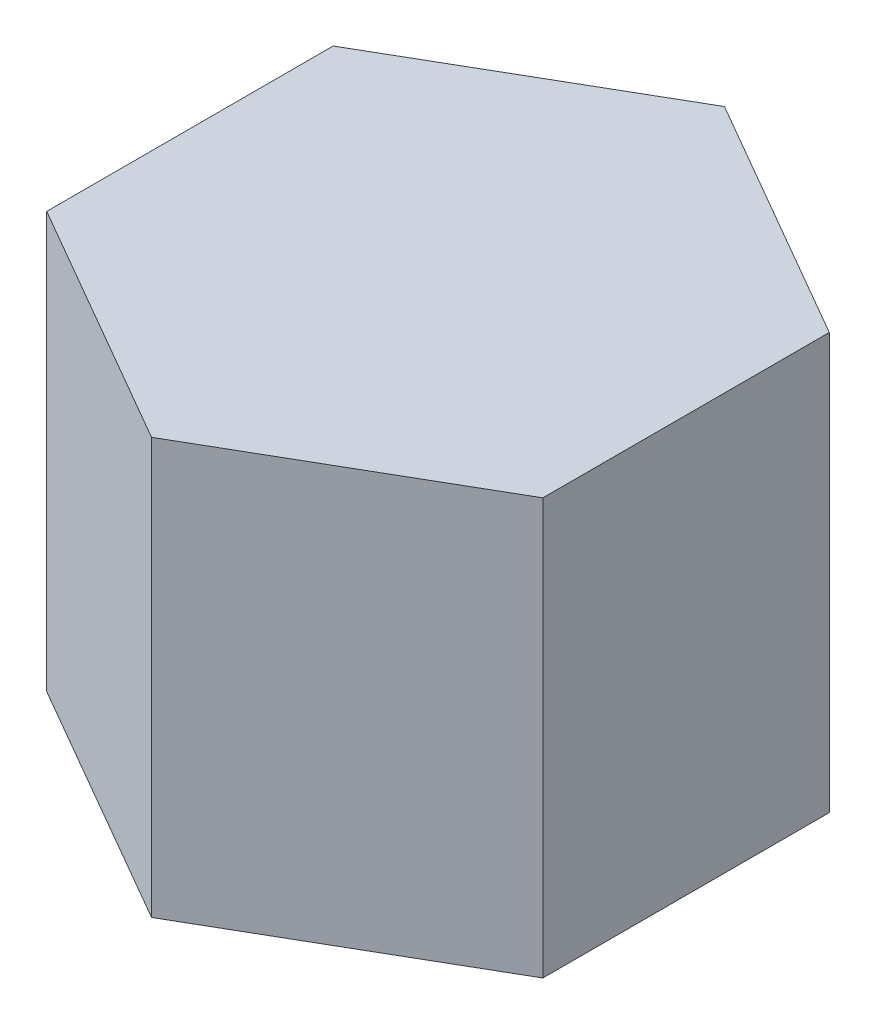
ISO-10303-21;
HEADER;
FILE_DESCRIPTION(('STEP AP214'),'2;1');
FILE_NAME('part.step','',(''),(''),'','','');
FILE_SCHEMA(('AUTOMOTIVE_DESIGN { 1 0 10303 214 1 1 1 1 }'));
ENDSEC;
DATA;
#1=APPLICATION_CONTEXT('core data for automotive mechanical design processes');
#2=APPLICATION_PROTOCOL_DEFINITION('international standard','automotive_design',2000,#1);
#3=PRODUCT_CONTEXT('',#1,'mechanical');
#4=PRODUCT('Part','Part','',(#3));
#5=PRODUCT_RELATED_PRODUCT_CATEGORY('part','',(#4));
#6=PRODUCT_DEFINITION_FORMATION('','',#4);
#7=PRODUCT_DEFINITION_CONTEXT('part definition',#1,'design');
#8=PRODUCT_DEFINITION('design','',#6,#7);
#9=PRODUCT_DEFINITION_SHAPE('','',#8);
#10=(LENGTH_UNIT() NAMED_UNIT(*) SI_UNIT(.MILLI.,.METRE.));
#11=(NAMED_UNIT(*) PLANE_ANGLE_UNIT() SI_UNIT($,.RADIAN.));
#12=(NAMED_UNIT(*) SI_UNIT($,.STERADIAN.) SOLID_ANGLE_UNIT());
#13=UNCERTAINTY_MEASURE_WITH_UNIT(LENGTH_MEASURE(1.E-05),#10,'distance_accuracy_value','');
#14=(GEOMETRIC_REPRESENTATION_CONTEXT(3) GLOBAL_UNCERTAINTY_ASSIGNED_CONTEXT((#13)) GLOBAL_UNIT_ASSIGNED_CONTEXT((#10,
#11,#12)) REPRESENTATION_CONTEXT('',''));
#15=CARTESIAN_POINT('',(0.,0.,0.));
#16=DIRECTION('',(0.,0.,1.));
#17=DIRECTION('',(1.,0.,0.));
#18=AXIS2_PLACEMENT_3D('',#15,#16,#17);
#19=CARTESIAN_POINT('',(202.142660308706,-148.537700895744,287.176844201572));
#20=DIRECTION('',(-0.499999999999943,0.,-0.866025403784472));
#21=DIRECTION('',(-0.866025403784472,0.,0.499999999999943));
#22=AXIS2_PLACEMENT_3D('',#19,#20,#21);
#23=PLANE('',#22);
#24=CARTESIAN_POINT('',(201.839551417382,-149.045793579175,287.351844201572));
#25=DIRECTION('',(0.866025403784471,0.,-0.499999999999943));
#26=VECTOR('',#25,1.);
#27=LINE('',#24,#26);
#28=CARTESIAN_POINT('',(201.839551417382,-149.045793579175,287.351844201572));
#29=VERTEX_POINT('',#28);
#30=CARTESIAN_POINT('',(202.142660308706,-149.045793579175,287.176844201572));
#31=VERTEX_POINT('',#30);
#32=EDGE_CURVE('E170',#29,#31,#27,.T.);
#33=ORIENTED_EDGE('',*,*,#32,.T.);
#34=CARTESIAN_POINT('',(202.142660308706,-148.537700895744,287.176844201572));
#35=DIRECTION('',(0.,-1.,0.));
#36=VECTOR('',#35,1.);
#37=LINE('',#34,#36);
#38=CARTESIAN_POINT('',(202.142660308706,-148.537700895744,287.176844201572));
#39=VERTEX_POINT('',#38);
#40=EDGE_CURVE('E35',#39,#31,#37,.T.);
#41=ORIENTED_EDGE('',*,*,#40,.F.);
#42=CARTESIAN_POINT('',(201.839551417382,-148.537700895744,287.351844201572));
#43=DIRECTION('',(0.866025403784471,0.,-0.499999999999943));
#44=VECTOR('',#43,1.);
#45=LINE('',#42,#44);
#46=CARTESIAN_POINT('',(201.839551417382,-148.537700895744,287.351844201572));
#47=VERTEX_POINT('',#46);
#48=EDGE_CURVE('E159',#47,#39,#45,.T.);
#49=ORIENTED_EDGE('',*,*,#48,.F.);
#50=CARTESIAN_POINT('',(201.839551417382,-148.537700895744,287.351844201572));
#51=DIRECTION('',(0.,-1.,0.));
#52=VECTOR('',#51,1.);
#53=LINE('',#50,#52);
#54=EDGE_CURVE('E10',#47,#29,#53,.T.);
#55=ORIENTED_EDGE('',*,*,#54,.T.);
#56=EDGE_LOOP('',(#33,#41,#49,#55));
#57=FACE_BOUND('',#56,.T.);
#58=ADVANCED_FACE('F16',(#57),#23,.F.);
#59=CARTESIAN_POINT('',(201.839551417382,-148.537700895744,287.351844201572));
#60=DIRECTION('',(0.500000000000062,0.,-0.866025403784403));
#61=DIRECTION('',(-0.866025403784403,0.,-0.500000000000062));
#62=AXIS2_PLACEMENT_3D('',#59,#60,#61);
#63=PLANE('',#62);
#64=CARTESIAN_POINT('',(201.536442526057,-149.045793579175,287.176844201572));
#65=DIRECTION('',(0.866025403784403,0.,0.500000000000062));
#66=VECTOR('',#65,1.);
#67=LINE('',#64,#66);
#68=CARTESIAN_POINT('',(201.536442526057,-149.045793579175,287.176844201572));
#69=VERTEX_POINT('',#68);
#70=EDGE_CURVE('E167',#69,#29,#67,.T.);
#71=ORIENTED_EDGE('',*,*,#70,.T.);
#72=ORIENTED_EDGE('',*,*,#54,.F.);
#73=CARTESIAN_POINT('',(201.536442526057,-148.537700895744,287.176844201572));
#74=DIRECTION('',(0.866025403784403,0.,0.500000000000062));
#75=VECTOR('',#74,1.);
#76=LINE('',#73,#75);
#77=CARTESIAN_POINT('',(201.536442526057,-148.537700895744,287.176844201572));
#78=VERTEX_POINT('',#77);
#79=EDGE_CURVE('E156',#78,#47,#76,.T.);
#80=ORIENTED_EDGE('',*,*,#79,.F.);
#81=CARTESIAN_POINT('',(201.536442526057,-148.537700895744,287.176844201572));
#82=DIRECTION('',(0.,-1.,0.));
#83=VECTOR('',#82,1.);
#84=LINE('',#81,#83);
#85=EDGE_CURVE('E27',#78,#69,#84,.T.);
#86=ORIENTED_EDGE('',*,*,#85,.T.);
#87=EDGE_LOOP('',(#71,#72,#80,#86));
#88=FACE_BOUND('',#87,.T.);
#89=ADVANCED_FACE('F189',(#88),#63,.F.);
#90=CARTESIAN_POINT('',(201.536442526057,-148.537700895744,290.831971220494));
#91=DIRECTION('',(1.,0.,0.));
#92=DIRECTION('',(0.,1.,0.));
#93=AXIS2_PLACEMENT_3D('',#90,#91,#92);
#94=PLANE('',#93);
#95=CARTESIAN_POINT('',(201.536442526057,-149.045793579175,286.826844201572));
#96=DIRECTION('',(0.,0.,1.));
#97=VECTOR('',#96,1.);
#98=LINE('',#95,#97);
#99=CARTESIAN_POINT('',(201.536442526057,-149.045793579175,286.826844201572));
#100=VERTEX_POINT('',#99);
#101=EDGE_CURVE('E163',#100,#69,#98,.T.);
#102=ORIENTED_EDGE('',*,*,#101,.T.);
#103=ORIENTED_EDGE('',*,*,#85,.F.);
#104=CARTESIAN_POINT('',(201.536442526057,-148.537700895744,286.826844201572));
#105=DIRECTION('',(0.,0.,1.));
#106=VECTOR('',#105,1.);
#107=LINE('',#104,#106);
#108=CARTESIAN_POINT('',(201.536442526057,-148.537700895744,286.826844201572));
#109=VERTEX_POINT('',#108);
#110=EDGE_CURVE('E106',#109,#78,#107,.T.);
#111=ORIENTED_EDGE('',*,*,#110,.F.);
#112=CARTESIAN_POINT('',(201.536442526057,-148.537700895744,286.826844201572));
#113=DIRECTION('',(0.,-1.,0.));
#114=VECTOR('',#113,1.);
#115=LINE('',#112,#114);
#116=EDGE_CURVE('E94',#109,#100,#115,.T.);
#117=ORIENTED_EDGE('',*,*,#116,.T.);
#118=EDGE_LOOP('',(#102,#103,#111,#117));
#119=FACE_BOUND('',#118,.T.);
#120=ADVANCED_FACE('F198',(#119),#94,.F.);
#121=CARTESIAN_POINT('',(201.536442526057,-148.537700895744,286.826844201572));
#122=DIRECTION('',(0.499999999999978,0.,0.866025403784452));
#123=DIRECTION('',(0.866025403784452,0.,-0.499999999999978));
#124=AXIS2_PLACEMENT_3D('',#121,#122,#123);
#125=PLANE('',#124);
#126=CARTESIAN_POINT('',(201.839551417382,-149.045793579175,286.651844201572));
#127=DIRECTION('',(-0.866025403784452,0.,0.499999999999978));
#128=VECTOR('',#127,1.);
#129=LINE('',#126,#128);
#130=CARTESIAN_POINT('',(201.839551417382,-149.045793579175,286.651844201572));
#131=VERTEX_POINT('',#130);
#132=EDGE_CURVE('E162',#131,#100,#129,.T.);
#133=ORIENTED_EDGE('',*,*,#132,.T.);
#134=ORIENTED_EDGE('',*,*,#116,.F.);
#135=CARTESIAN_POINT('',(201.839551417382,-148.537700895744,286.651844201572));
#136=DIRECTION('',(-0.866025403784452,0.,0.499999999999978));
#137=VECTOR('',#136,1.);
#138=LINE('',#135,#137);
#139=CARTESIAN_POINT('',(201.839551417382,-148.537700895744,286.651844201572));
#140=VERTEX_POINT('',#139);
#141=EDGE_CURVE('E98',#140,#109,#138,.T.);
#142=ORIENTED_EDGE('',*,*,#141,.F.);
#143=CARTESIAN_POINT('',(201.839551417382,-148.537700895744,286.651844201572));
#144=DIRECTION('',(0.,-1.,0.));
#145=VECTOR('',#144,1.);
#146=LINE('',#143,#145);
#147=EDGE_CURVE('E79',#140,#131,#146,.T.);
#148=ORIENTED_EDGE('',*,*,#147,.T.);
#149=EDGE_LOOP('',(#133,#134,#142,#148));
#150=FACE_BOUND('',#149,.T.);
#151=ADVANCED_FACE('F100',(#150),#125,.F.);
#152=CARTESIAN_POINT('',(201.839551417382,-148.537700895744,286.651844201572));
#153=DIRECTION('',(-0.499999999999978,0.,0.866025403784452));
#154=DIRECTION('',(0.866025403784452,0.,0.499999999999978));
#155=AXIS2_PLACEMENT_3D('',#152,#153,#154);
#156=PLANE('',#155);
#157=CARTESIAN_POINT('',(202.142660308706,-149.045793579175,286.826844201572));
#158=DIRECTION('',(-0.866025403784452,0.,-0.499999999999978));
#159=VECTOR('',#158,1.);
#160=LINE('',#157,#159);
#161=CARTESIAN_POINT('',(202.142660308706,-149.045793579175,286.826844201572));
#162=VERTEX_POINT('',#161);
#163=EDGE_CURVE('E88',#162,#131,#160,.T.);
#164=ORIENTED_EDGE('',*,*,#163,.T.);
#165=ORIENTED_EDGE('',*,*,#147,.F.);
#166=CARTESIAN_POINT('',(202.142660308706,-148.537700895744,286.826844201572));
#167=DIRECTION('',(-0.866025403784452,0.,-0.499999999999978));
#168=VECTOR('',#167,1.);
#169=LINE('',#166,#168);
#170=CARTESIAN_POINT('',(202.142660308706,-148.537700895744,286.826844201572));
#171=VERTEX_POINT('',#170);
#172=EDGE_CURVE('E84',#171,#140,#169,.T.);
#173=ORIENTED_EDGE('',*,*,#172,.F.);
#174=CARTESIAN_POINT('',(202.142660308706,-148.537700895744,286.826844201572));
#175=DIRECTION('',(0.,-1.,0.));
#176=VECTOR('',#175,1.);
#177=LINE('',#174,#176);
#178=EDGE_CURVE('E58',#171,#162,#177,.T.);
#179=ORIENTED_EDGE('',*,*,#178,.T.);
#180=EDGE_LOOP('',(#164,#165,#173,#179));
#181=FACE_BOUND('',#180,.T.);
#182=ADVANCED_FACE('F82',(#181),#156,.F.);
#183=CARTESIAN_POINT('',(202.142660308706,-148.537700895744,290.831971220494));
#184=DIRECTION('',(-1.,0.,0.));
#185=DIRECTION('',(0.,-1.,0.));
#186=AXIS2_PLACEMENT_3D('',#183,#184,#185);
#187=PLANE('',#186);
#188=CARTESIAN_POINT('',(202.142660308706,-149.045793579175,287.176844201572));
#189=DIRECTION('',(0.,0.,-1.));
#190=VECTOR('',#189,1.);
#191=LINE('',#188,#190);
#192=EDGE_CURVE('E160',#31,#162,#191,.T.);
#193=ORIENTED_EDGE('',*,*,#192,.T.);
#194=ORIENTED_EDGE('',*,*,#178,.F.);
#195=CARTESIAN_POINT('',(202.142660308706,-148.537700895744,287.176844201572));
#196=DIRECTION('',(0.,0.,-1.));
#197=VECTOR('',#196,1.);
#198=LINE('',#195,#197);
#199=EDGE_CURVE('E112',#39,#171,#198,.T.);
#200=ORIENTED_EDGE('',*,*,#199,.F.);
#201=ORIENTED_EDGE('',*,*,#40,.T.);
#202=EDGE_LOOP('',(#193,#194,#200,#201));
#203=FACE_BOUND('',#202,.T.);
#204=ADVANCED_FACE('F131',(#203),#187,.F.);
#205=CARTESIAN_POINT('',(206.339551417382,-148.537700895744,290.831971220494));
#206=DIRECTION('',(0.,-1.,0.));
#207=DIRECTION('',(1.,0.,0.));
#208=AXIS2_PLACEMENT_3D('',#205,#206,#207);
#209=PLANE('',#208);
#210=ORIENTED_EDGE('',*,*,#48,.T.);
#211=ORIENTED_EDGE('',*,*,#199,.T.);
#212=ORIENTED_EDGE('',*,*,#172,.T.);
#213=ORIENTED_EDGE('',*,*,#141,.T.);
#214=ORIENTED_EDGE('',*,*,#110,.T.);
#215=ORIENTED_EDGE('',*,*,#79,.T.);
#216=EDGE_LOOP('',(#210,#211,#212,#213,#214,#215));
#217=FACE_BOUND('',#216,.T.);
#218=ADVANCED_FACE('F111',(#217),#209,.F.);
#219=CARTESIAN_POINT('',(206.339551417382,-149.045793579175,290.831971220494));
#220=DIRECTION('',(0.,-1.,0.));
#221=DIRECTION('',(1.,0.,0.));
#222=AXIS2_PLACEMENT_3D('',#219,#220,#221);
#223=PLANE('',#222);
#224=ORIENTED_EDGE('',*,*,#32,.F.);
#225=ORIENTED_EDGE('',*,*,#70,.F.);
#226=ORIENTED_EDGE('',*,*,#101,.F.);
#227=ORIENTED_EDGE('',*,*,#132,.F.);
#228=ORIENTED_EDGE('',*,*,#163,.F.);
#229=ORIENTED_EDGE('',*,*,#192,.F.);
#230=EDGE_LOOP('',(#224,#225,#226,#227,#228,#229));
#231=FACE_BOUND('',#230,.T.);
#232=ADVANCED_FACE('F130',(#231),#223,.T.);
#233=CLOSED_SHELL('',(#58,#89,#120,#151,#182,#204,#218,#232));
#234=MANIFOLD_SOLID_BREP('B1',#233);
#235=ADVANCED_BREP_SHAPE_REPRESENTATION('',(#18,#234),#14);
#236=SHAPE_DEFINITION_REPRESENTATION(#9,#235);
ENDSEC;
END-ISO-10303-21;
